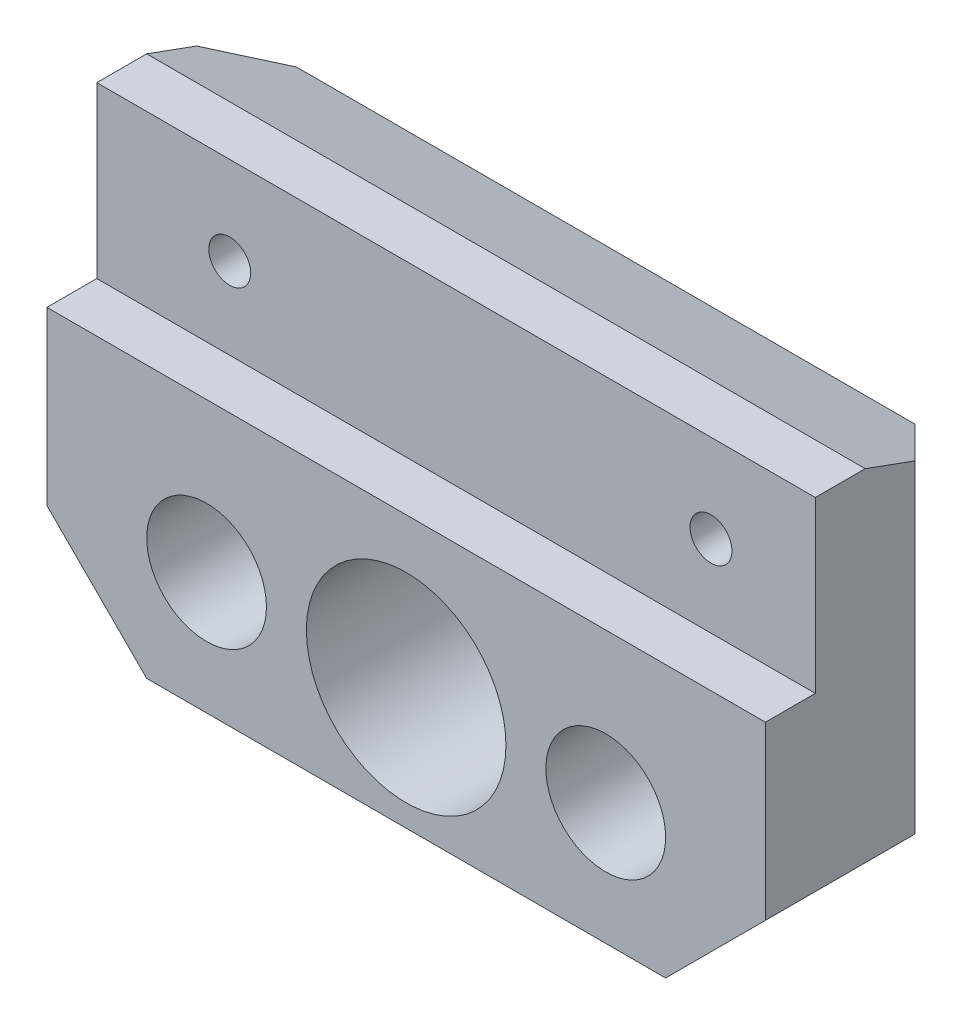
ISO-10303-21;
HEADER;
FILE_DESCRIPTION(('STEP AP214'),'2;1');
FILE_NAME('part.step','',(''),(''),'','','');
FILE_SCHEMA(('AUTOMOTIVE_DESIGN { 1 0 10303 214 1 1 1 1 }'));
ENDSEC;
DATA;
#1=APPLICATION_CONTEXT('core data for automotive mechanical design processes');
#2=APPLICATION_PROTOCOL_DEFINITION('international standard','automotive_design',2000,#1);
#3=PRODUCT_CONTEXT('',#1,'mechanical');
#4=PRODUCT('Part','Part','',(#3));
#5=PRODUCT_RELATED_PRODUCT_CATEGORY('part','',(#4));
#6=PRODUCT_DEFINITION_FORMATION('','',#4);
#7=PRODUCT_DEFINITION_CONTEXT('part definition',#1,'design');
#8=PRODUCT_DEFINITION('design','',#6,#7);
#9=PRODUCT_DEFINITION_SHAPE('','',#8);
#10=(LENGTH_UNIT() NAMED_UNIT(*) SI_UNIT(.MILLI.,.METRE.));
#11=(NAMED_UNIT(*) PLANE_ANGLE_UNIT() SI_UNIT($,.RADIAN.));
#12=(NAMED_UNIT(*) SI_UNIT($,.STERADIAN.) SOLID_ANGLE_UNIT());
#13=UNCERTAINTY_MEASURE_WITH_UNIT(LENGTH_MEASURE(1.E-05),#10,'distance_accuracy_value','');
#14=(GEOMETRIC_REPRESENTATION_CONTEXT(3) GLOBAL_UNCERTAINTY_ASSIGNED_CONTEXT((#13)) GLOBAL_UNIT_ASSIGNED_CONTEXT((#10,
#11,#12)) REPRESENTATION_CONTEXT('',''));
#15=CARTESIAN_POINT('',(0.,0.,0.));
#16=DIRECTION('',(0.,0.,1.));
#17=DIRECTION('',(1.,0.,0.));
#18=AXIS2_PLACEMENT_3D('',#15,#16,#17);
#19=CARTESIAN_POINT('',(53.9613003244463,-9.9,20.));
#20=DIRECTION('',(0.,0.,-1.));
#21=DIRECTION('',(-1.,0.,0.));
#22=AXIS2_PLACEMENT_3D('',#19,#20,#21);
#23=CYLINDRICAL_SURFACE('',#22,9.99999999999999);
#24=CARTESIAN_POINT('',(53.9613003244463,-9.9,20.));
#25=DIRECTION('',(0.,0.,1.));
#26=DIRECTION('',(1.,0.,0.));
#27=AXIS2_PLACEMENT_3D('',#24,#25,#26);
#28=CIRCLE('',#27,9.99999999999999);
#29=CARTESIAN_POINT('',(63.9613003244463,-9.9,20.));
#30=VERTEX_POINT('',#29);
#31=EDGE_CURVE('E178',#30,#30,#28,.T.);
#32=ORIENTED_EDGE('',*,*,#31,.T.);
#33=EDGE_LOOP('',(#32));
#34=FACE_BOUND('',#33,.T.);
#35=CARTESIAN_POINT('',(53.9613003244463,-9.9,3.4));
#36=DIRECTION('',(0.,0.,-1.));
#37=DIRECTION('',(-1.,0.,0.));
#38=AXIS2_PLACEMENT_3D('',#35,#36,#37);
#39=CIRCLE('',#38,9.99999999999999);
#40=CARTESIAN_POINT('',(43.9613003244463,-9.9,3.4));
#41=VERTEX_POINT('',#40);
#42=EDGE_CURVE('E43',#41,#41,#39,.T.);
#43=ORIENTED_EDGE('',*,*,#42,.T.);
#44=EDGE_LOOP('',(#43));
#45=FACE_BOUND('',#44,.T.);
#46=ADVANCED_FACE('F39',(#34,#45),#23,.F.);
#47=CARTESIAN_POINT('',(0.,0.,20.));
#48=DIRECTION('',(0.,0.,1.));
#49=DIRECTION('',(1.,0.,0.));
#50=AXIS2_PLACEMENT_3D('',#47,#48,#49);
#51=PLANE('',#50);
#52=DIRECTION('',(-1.,0.,0.));
#53=VECTOR('',#52,1.);
#54=CARTESIAN_POINT('',(97.9613003244462,5.1,20.));
#55=LINE('',#54,#53);
#56=CARTESIAN_POINT('',(89.9613003244463,5.1,20.));
#57=VERTEX_POINT('',#56);
#58=CARTESIAN_POINT('',(17.9613003244463,5.1,20.));
#59=VERTEX_POINT('',#58);
#60=EDGE_CURVE('E163',#57,#59,#55,.T.);
#61=ORIENTED_EDGE('',*,*,#60,.T.);
#62=DIRECTION('',(0.,-1.,0.));
#63=VECTOR('',#62,1.);
#64=CARTESIAN_POINT('',(17.9613003244463,22.1,20.));
#65=LINE('',#64,#63);
#66=CARTESIAN_POINT('',(17.9613003244463,-12.1,20.));
#67=VERTEX_POINT('',#66);
#68=EDGE_CURVE('E184',#59,#67,#65,.T.);
#69=ORIENTED_EDGE('',*,*,#68,.T.);
#70=DIRECTION('',(-0.707106781186547,0.707106781186548,0.));
#71=VECTOR('',#70,1.);
#72=CARTESIAN_POINT('',(2.93065016222317,2.93065016222317,20.));
#73=LINE('',#72,#71);
#74=CARTESIAN_POINT('',(27.9613003244463,-22.1,20.));
#75=VERTEX_POINT('',#74);
#76=EDGE_CURVE('E207',#67,#75,#73,.F.);
#77=ORIENTED_EDGE('',*,*,#76,.T.);
#78=DIRECTION('',(1.,0.,0.));
#79=VECTOR('',#78,1.);
#80=CARTESIAN_POINT('',(17.9613003244463,-22.1,20.));
#81=LINE('',#80,#79);
#82=CARTESIAN_POINT('',(79.9613003244462,-22.1,20.));
#83=VERTEX_POINT('',#82);
#84=EDGE_CURVE('E186',#75,#83,#81,.T.);
#85=ORIENTED_EDGE('',*,*,#84,.T.);
#86=DIRECTION('',(-0.707106781186549,-0.707106781186546,0.));
#87=VECTOR('',#86,1.);
#88=CARTESIAN_POINT('',(51.030650162223,-51.0306501622232,20.));
#89=LINE('',#88,#87);
#90=CARTESIAN_POINT('',(89.9613003244463,-12.1,20.));
#91=VERTEX_POINT('',#90);
#92=EDGE_CURVE('E215',#83,#91,#89,.F.);
#93=ORIENTED_EDGE('',*,*,#92,.T.);
#94=DIRECTION('',(0.,1.,0.));
#95=VECTOR('',#94,1.);
#96=CARTESIAN_POINT('',(89.9613003244463,22.1,20.));
#97=LINE('',#96,#95);
#98=EDGE_CURVE('E189',#91,#57,#97,.T.);
#99=ORIENTED_EDGE('',*,*,#98,.T.);
#100=EDGE_LOOP('',(#61,#69,#77,#85,#93,#99));
#101=FACE_BOUND('',#100,.T.);
#102=CARTESIAN_POINT('',(73.9613003244463,-9.90000000000001,20.));
#103=DIRECTION('',(0.,0.,1.));
#104=DIRECTION('',(1.,0.,0.));
#105=AXIS2_PLACEMENT_3D('',#102,#103,#104);
#106=CIRCLE('',#105,6.);
#107=CARTESIAN_POINT('',(79.9613003244463,-9.90000000000001,20.));
#108=VERTEX_POINT('',#107);
#109=EDGE_CURVE('E175',#108,#108,#106,.T.);
#110=ORIENTED_EDGE('',*,*,#109,.F.);
#111=EDGE_LOOP('',(#110));
#112=FACE_BOUND('',#111,.T.);
#113=ORIENTED_EDGE('',*,*,#31,.F.);
#114=EDGE_LOOP('',(#113));
#115=FACE_BOUND('',#114,.T.);
#116=CARTESIAN_POINT('',(33.9613003244463,-9.90000000000001,20.));
#117=DIRECTION('',(0.,0.,1.));
#118=DIRECTION('',(1.,0.,0.));
#119=AXIS2_PLACEMENT_3D('',#116,#117,#118);
#120=CIRCLE('',#119,6.);
#121=CARTESIAN_POINT('',(39.9613003244463,-9.90000000000001,20.));
#122=VERTEX_POINT('',#121);
#123=EDGE_CURVE('E169',#122,#122,#120,.T.);
#124=ORIENTED_EDGE('',*,*,#123,.F.);
#125=EDGE_LOOP('',(#124));
#126=FACE_BOUND('',#125,.T.);
#127=ADVANCED_FACE('F285',(#101,#112,#115,#126),#51,.T.);
#128=CARTESIAN_POINT('',(0.,0.,0.));
#129=DIRECTION('',(0.,0.,1.));
#130=DIRECTION('',(1.,0.,0.));
#131=AXIS2_PLACEMENT_3D('',#128,#129,#130);
#132=PLANE('',#131);
#133=CARTESIAN_POINT('',(53.9613003244463,-9.9,0.));
#134=DIRECTION('',(0.,0.,-1.));
#135=DIRECTION('',(-1.,0.,0.));
#136=AXIS2_PLACEMENT_3D('',#133,#134,#135);
#137=CIRCLE('',#136,12.);
#138=CARTESIAN_POINT('',(41.9613003244463,-9.9,0.));
#139=VERTEX_POINT('',#138);
#140=EDGE_CURVE('E151',#139,#139,#137,.T.);
#141=ORIENTED_EDGE('',*,*,#140,.F.);
#142=EDGE_LOOP('',(#141));
#143=FACE_BOUND('',#142,.T.);
#144=DIRECTION('',(0.707106781186547,-0.707106781186548,0.));
#145=VECTOR('',#144,1.);
#146=CARTESIAN_POINT('',(27.9613003244463,-22.1,0.));
#147=LINE('',#146,#145);
#148=CARTESIAN_POINT('',(27.9613003244463,-22.1,0.));
#149=VERTEX_POINT('',#148);
#150=CARTESIAN_POINT('',(22.9613003244463,-17.1,0.));
#151=VERTEX_POINT('',#150);
#152=EDGE_CURVE('E201',#149,#151,#147,.F.);
#153=ORIENTED_EDGE('',*,*,#152,.T.);
#154=DIRECTION('',(0.,1.,0.));
#155=VECTOR('',#154,1.);
#156=CARTESIAN_POINT('',(22.9613003244463,0.,0.));
#157=LINE('',#156,#155);
#158=CARTESIAN_POINT('',(22.9613003244463,18.460297657338,0.));
#159=VERTEX_POINT('',#158);
#160=EDGE_CURVE('E236',#151,#159,#157,.T.);
#161=ORIENTED_EDGE('',*,*,#160,.T.);
#162=DIRECTION('',(1.,0.,0.));
#163=VECTOR('',#162,1.);
#164=CARTESIAN_POINT('',(0.,18.460297657338,0.));
#165=LINE('',#164,#163);
#166=CARTESIAN_POINT('',(84.9613003244462,18.460297657338,0.));
#167=VERTEX_POINT('',#166);
#168=EDGE_CURVE('E223',#159,#167,#165,.T.);
#169=ORIENTED_EDGE('',*,*,#168,.T.);
#170=DIRECTION('',(0.,-1.,0.));
#171=VECTOR('',#170,1.);
#172=CARTESIAN_POINT('',(84.9613003244462,0.,0.));
#173=LINE('',#172,#171);
#174=CARTESIAN_POINT('',(84.9613003244462,-17.1,0.));
#175=VERTEX_POINT('',#174);
#176=EDGE_CURVE('E234',#167,#175,#173,.T.);
#177=ORIENTED_EDGE('',*,*,#176,.T.);
#178=DIRECTION('',(0.707106781186549,0.707106781186546,0.));
#179=VECTOR('',#178,1.);
#180=CARTESIAN_POINT('',(89.9613003244463,-12.1,0.));
#181=LINE('',#180,#179);
#182=CARTESIAN_POINT('',(79.9613003244462,-22.1,0.));
#183=VERTEX_POINT('',#182);
#184=EDGE_CURVE('E211',#175,#183,#181,.F.);
#185=ORIENTED_EDGE('',*,*,#184,.T.);
#186=DIRECTION('',(1.,0.,0.));
#187=VECTOR('',#186,1.);
#188=CARTESIAN_POINT('',(17.9613003244463,-22.1,0.));
#189=LINE('',#188,#187);
#190=EDGE_CURVE('E183',#149,#183,#189,.T.);
#191=ORIENTED_EDGE('',*,*,#190,.F.);
#192=EDGE_LOOP('',(#153,#161,#169,#177,#185,#191));
#193=FACE_BOUND('',#192,.T.);
#194=CARTESIAN_POINT('',(73.9613003244463,-9.90000000000001,0.));
#195=DIRECTION('',(0.,0.,1.));
#196=DIRECTION('',(1.,0.,0.));
#197=AXIS2_PLACEMENT_3D('',#194,#195,#196);
#198=CIRCLE('',#197,6.);
#199=CARTESIAN_POINT('',(79.9613003244463,-9.90000000000001,0.));
#200=VERTEX_POINT('',#199);
#201=EDGE_CURVE('E172',#200,#200,#198,.T.);
#202=ORIENTED_EDGE('',*,*,#201,.T.);
#203=EDGE_LOOP('',(#202));
#204=FACE_BOUND('',#203,.T.);
#205=CARTESIAN_POINT('',(33.9613003244463,-9.90000000000001,0.));
#206=DIRECTION('',(0.,0.,1.));
#207=DIRECTION('',(1.,0.,0.));
#208=AXIS2_PLACEMENT_3D('',#205,#206,#207);
#209=CIRCLE('',#208,6.);
#210=CARTESIAN_POINT('',(39.9613003244463,-9.90000000000001,0.));
#211=VERTEX_POINT('',#210);
#212=EDGE_CURVE('E168',#211,#211,#209,.T.);
#213=ORIENTED_EDGE('',*,*,#212,.T.);
#214=EDGE_LOOP('',(#213));
#215=FACE_BOUND('',#214,.T.);
#216=ADVANCED_FACE('F275',(#143,#193,#204,#215),#132,.F.);
#217=CARTESIAN_POINT('',(17.9613003244463,22.1,20.));
#218=DIRECTION('',(1.,0.,0.));
#219=DIRECTION('',(0.,0.,-1.));
#220=AXIS2_PLACEMENT_3D('',#217,#218,#219);
#221=PLANE('',#220);
#222=ORIENTED_EDGE('',*,*,#68,.F.);
#223=DIRECTION('',(0.,0.,1.));
#224=VECTOR('',#223,1.);
#225=CARTESIAN_POINT('',(17.9613003244463,5.1,15.));
#226=LINE('',#225,#224);
#227=CARTESIAN_POINT('',(17.9613003244463,5.1,15.));
#228=VERTEX_POINT('',#227);
#229=EDGE_CURVE('E160',#228,#59,#226,.T.);
#230=ORIENTED_EDGE('',*,*,#229,.F.);
#231=DIRECTION('',(0.,-1.,0.));
#232=VECTOR('',#231,1.);
#233=CARTESIAN_POINT('',(17.9613003244463,22.1,15.));
#234=LINE('',#233,#232);
#235=CARTESIAN_POINT('',(17.9613003244463,22.1,15.));
#236=VERTEX_POINT('',#235);
#237=EDGE_CURVE('E157',#236,#228,#234,.T.);
#238=ORIENTED_EDGE('',*,*,#237,.F.);
#239=DIRECTION('',(0.,0.,-1.));
#240=VECTOR('',#239,1.);
#241=CARTESIAN_POINT('',(17.9613003244463,22.1,20.));
#242=LINE('',#241,#240);
#243=CARTESIAN_POINT('',(17.9613003244463,22.1,10.0000000000001));
#244=VERTEX_POINT('',#243);
#245=EDGE_CURVE('E192',#236,#244,#242,.T.);
#246=ORIENTED_EDGE('',*,*,#245,.T.);
#247=DIRECTION('',(0.,0.342020143325667,0.939692620785909));
#248=VECTOR('',#247,1.);
#249=CARTESIAN_POINT('',(17.9613003244463,22.1,10.0000000000001));
#250=LINE('',#249,#248);
#251=CARTESIAN_POINT('',(17.9613003244463,20.280148828669,5.));
#252=VERTEX_POINT('',#251);
#253=EDGE_CURVE('E220',#244,#252,#250,.F.);
#254=ORIENTED_EDGE('',*,*,#253,.T.);
#255=DIRECTION('',(0.,-1.,0.));
#256=VECTOR('',#255,1.);
#257=CARTESIAN_POINT('',(17.9613003244463,22.1,5.));
#258=LINE('',#257,#256);
#259=CARTESIAN_POINT('',(17.9613003244463,-12.1,5.));
#260=VERTEX_POINT('',#259);
#261=EDGE_CURVE('E229',#252,#260,#258,.T.);
#262=ORIENTED_EDGE('',*,*,#261,.T.);
#263=DIRECTION('',(0.,0.,1.));
#264=VECTOR('',#263,1.);
#265=CARTESIAN_POINT('',(17.9613003244463,-12.1,20.));
#266=LINE('',#265,#264);
#267=EDGE_CURVE('E204',#260,#67,#266,.T.);
#268=ORIENTED_EDGE('',*,*,#267,.T.);
#269=EDGE_LOOP('',(#222,#230,#238,#246,#254,#262,#268));
#270=FACE_BOUND('',#269,.T.);
#271=ADVANCED_FACE('F264',(#270),#221,.F.);
#272=CARTESIAN_POINT('',(17.9613003244463,-22.1,20.));
#273=DIRECTION('',(0.,1.,0.));
#274=DIRECTION('',(0.,0.,1.));
#275=AXIS2_PLACEMENT_3D('',#272,#273,#274);
#276=PLANE('',#275);
#277=ORIENTED_EDGE('',*,*,#190,.T.);
#278=DIRECTION('',(0.,0.,1.));
#279=VECTOR('',#278,1.);
#280=CARTESIAN_POINT('',(79.9613003244462,-22.1,20.));
#281=LINE('',#280,#279);
#282=EDGE_CURVE('E213',#183,#83,#281,.T.);
#283=ORIENTED_EDGE('',*,*,#282,.T.);
#284=ORIENTED_EDGE('',*,*,#84,.F.);
#285=DIRECTION('',(0.,0.,-1.));
#286=VECTOR('',#285,1.);
#287=CARTESIAN_POINT('',(27.9613003244463,-22.1,20.));
#288=LINE('',#287,#286);
#289=EDGE_CURVE('E198',#75,#149,#288,.T.);
#290=ORIENTED_EDGE('',*,*,#289,.T.);
#291=EDGE_LOOP('',(#277,#283,#284,#290));
#292=FACE_BOUND('',#291,.T.);
#293=ADVANCED_FACE('F279',(#292),#276,.F.);
#294=CARTESIAN_POINT('',(89.9613003244463,22.1,20.));
#295=DIRECTION('',(-1.,0.,0.));
#296=DIRECTION('',(0.,0.,1.));
#297=AXIS2_PLACEMENT_3D('',#294,#295,#296);
#298=PLANE('',#297);
#299=DIRECTION('',(0.,-1.,0.));
#300=VECTOR('',#299,1.);
#301=CARTESIAN_POINT('',(89.9613003244463,22.1,15.));
#302=LINE('',#301,#300);
#303=CARTESIAN_POINT('',(89.9613003244463,22.1,15.));
#304=VERTEX_POINT('',#303);
#305=CARTESIAN_POINT('',(89.9613003244463,5.1,15.));
#306=VERTEX_POINT('',#305);
#307=EDGE_CURVE('E55',#304,#306,#302,.T.);
#308=ORIENTED_EDGE('',*,*,#307,.T.);
#309=DIRECTION('',(0.,0.,1.));
#310=VECTOR('',#309,1.);
#311=CARTESIAN_POINT('',(89.9613003244463,5.1,20.));
#312=LINE('',#311,#310);
#313=EDGE_CURVE('E11',#306,#57,#312,.T.);
#314=ORIENTED_EDGE('',*,*,#313,.T.);
#315=ORIENTED_EDGE('',*,*,#98,.F.);
#316=DIRECTION('',(0.,0.,-1.));
#317=VECTOR('',#316,1.);
#318=CARTESIAN_POINT('',(89.9613003244463,-12.1,20.));
#319=LINE('',#318,#317);
#320=CARTESIAN_POINT('',(89.9613003244463,-12.1,5.));
#321=VERTEX_POINT('',#320);
#322=EDGE_CURVE('E209',#91,#321,#319,.T.);
#323=ORIENTED_EDGE('',*,*,#322,.T.);
#324=DIRECTION('',(0.,1.,0.));
#325=VECTOR('',#324,1.);
#326=CARTESIAN_POINT('',(89.9613003244463,22.1,5.));
#327=LINE('',#326,#325);
#328=CARTESIAN_POINT('',(89.9613003244462,20.280148828669,5.));
#329=VERTEX_POINT('',#328);
#330=EDGE_CURVE('E242',#321,#329,#327,.T.);
#331=ORIENTED_EDGE('',*,*,#330,.T.);
#332=DIRECTION('',(0.,-0.342020143325667,-0.939692620785909));
#333=VECTOR('',#332,1.);
#334=CARTESIAN_POINT('',(89.9613003244462,22.1,10.0000000000001));
#335=LINE('',#334,#333);
#336=CARTESIAN_POINT('',(89.9613003244463,22.1,10.0000000000001));
#337=VERTEX_POINT('',#336);
#338=EDGE_CURVE('E226',#329,#337,#335,.F.);
#339=ORIENTED_EDGE('',*,*,#338,.T.);
#340=DIRECTION('',(0.,0.,-1.));
#341=VECTOR('',#340,1.);
#342=CARTESIAN_POINT('',(89.9613003244463,22.1,20.));
#343=LINE('',#342,#341);
#344=EDGE_CURVE('E196',#304,#337,#343,.T.);
#345=ORIENTED_EDGE('',*,*,#344,.F.);
#346=EDGE_LOOP('',(#308,#314,#315,#323,#331,#339,#345));
#347=FACE_BOUND('',#346,.T.);
#348=ADVANCED_FACE('F252',(#347),#298,.F.);
#349=CARTESIAN_POINT('',(17.9613003244463,22.1,20.));
#350=DIRECTION('',(0.,-1.,0.));
#351=DIRECTION('',(0.,0.,-1.));
#352=AXIS2_PLACEMENT_3D('',#349,#350,#351);
#353=PLANE('',#352);
#354=ORIENTED_EDGE('',*,*,#245,.F.);
#355=DIRECTION('',(1.,0.,0.));
#356=VECTOR('',#355,1.);
#357=CARTESIAN_POINT('',(17.9613003244463,22.1,15.));
#358=LINE('',#357,#356);
#359=EDGE_CURVE('E48',#236,#304,#358,.T.);
#360=ORIENTED_EDGE('',*,*,#359,.T.);
#361=ORIENTED_EDGE('',*,*,#344,.T.);
#362=DIRECTION('',(-1.,0.,0.));
#363=VECTOR('',#362,1.);
#364=CARTESIAN_POINT('',(17.9613003244463,22.1,10.0000000000001));
#365=LINE('',#364,#363);
#366=EDGE_CURVE('E217',#337,#244,#365,.T.);
#367=ORIENTED_EDGE('',*,*,#366,.T.);
#368=EDGE_LOOP('',(#354,#360,#361,#367));
#369=FACE_BOUND('',#368,.T.);
#370=ADVANCED_FACE('F249',(#369),#353,.F.);
#371=CARTESIAN_POINT('',(73.9613003244463,-9.90000000000001,20.));
#372=DIRECTION('',(0.,0.,-1.));
#373=DIRECTION('',(-1.,0.,0.));
#374=AXIS2_PLACEMENT_3D('',#371,#372,#373);
#375=CYLINDRICAL_SURFACE('',#374,6.);
#376=ORIENTED_EDGE('',*,*,#109,.T.);
#377=EDGE_LOOP('',(#376));
#378=FACE_BOUND('',#377,.T.);
#379=ORIENTED_EDGE('',*,*,#201,.F.);
#380=EDGE_LOOP('',(#379));
#381=FACE_BOUND('',#380,.T.);
#382=ADVANCED_FACE('F315',(#378,#381),#375,.F.);
#383=CARTESIAN_POINT('',(33.9613003244463,-9.90000000000001,20.));
#384=DIRECTION('',(0.,0.,-1.));
#385=DIRECTION('',(-1.,0.,0.));
#386=AXIS2_PLACEMENT_3D('',#383,#384,#385);
#387=CYLINDRICAL_SURFACE('',#386,6.);
#388=ORIENTED_EDGE('',*,*,#123,.T.);
#389=EDGE_LOOP('',(#388));
#390=FACE_BOUND('',#389,.T.);
#391=ORIENTED_EDGE('',*,*,#212,.F.);
#392=EDGE_LOOP('',(#391));
#393=FACE_BOUND('',#392,.T.);
#394=ADVANCED_FACE('F330',(#390,#393),#387,.F.);
#395=CARTESIAN_POINT('',(27.9613003244463,-22.1,20.));
#396=DIRECTION('',(0.707106781186548,0.707106781186547,0.));
#397=DIRECTION('',(0.,0.,-1.));
#398=AXIS2_PLACEMENT_3D('',#395,#396,#397);
#399=PLANE('',#398);
#400=ORIENTED_EDGE('',*,*,#267,.F.);
#401=DIRECTION('',(0.577350269189626,-0.577350269189628,-0.577350269189623));
#402=VECTOR('',#401,1.);
#403=CARTESIAN_POINT('',(19.627966991113,-13.7666666666667,3.33333333333328));
#404=LINE('',#403,#402);
#405=EDGE_CURVE('E232',#260,#151,#404,.T.);
#406=ORIENTED_EDGE('',*,*,#405,.T.);
#407=ORIENTED_EDGE('',*,*,#152,.F.);
#408=ORIENTED_EDGE('',*,*,#289,.F.);
#409=ORIENTED_EDGE('',*,*,#76,.F.);
#410=EDGE_LOOP('',(#400,#406,#407,#408,#409));
#411=FACE_BOUND('',#410,.T.);
#412=ADVANCED_FACE('F270',(#411),#399,.F.);
#413=CARTESIAN_POINT('',(89.9613003244463,-12.1,20.));
#414=DIRECTION('',(-0.707106781186546,0.707106781186549,0.));
#415=DIRECTION('',(0.,0.,-1.));
#416=AXIS2_PLACEMENT_3D('',#413,#414,#415);
#417=PLANE('',#416);
#418=ORIENTED_EDGE('',*,*,#184,.F.);
#419=DIRECTION('',(0.577350269189627,0.577350269189625,0.577350269189625));
#420=VECTOR('',#419,1.);
#421=CARTESIAN_POINT('',(94.9613003244463,-7.10000000000003,9.99999999999998));
#422=LINE('',#421,#420);
#423=EDGE_CURVE('E63',#175,#321,#422,.T.);
#424=ORIENTED_EDGE('',*,*,#423,.T.);
#425=ORIENTED_EDGE('',*,*,#322,.F.);
#426=ORIENTED_EDGE('',*,*,#92,.F.);
#427=ORIENTED_EDGE('',*,*,#282,.F.);
#428=EDGE_LOOP('',(#418,#424,#425,#426,#427));
#429=FACE_BOUND('',#428,.T.);
#430=ADVANCED_FACE('F282',(#429),#417,.F.);
#431=CARTESIAN_POINT('',(17.9613003244463,22.1,10.0000000000001));
#432=DIRECTION('',(0.,-0.939692620785909,0.342020143325667));
#433=DIRECTION('',(-1.,0.,0.));
#434=AXIS2_PLACEMENT_3D('',#431,#432,#433);
#435=PLANE('',#434);
#436=ORIENTED_EDGE('',*,*,#168,.F.);
#437=DIRECTION('',(-0.684791078771738,0.249243569363952,0.684791078771735));
#438=VECTOR('',#437,1.);
#439=CARTESIAN_POINT('',(15.305994432273,21.2466011362917,7.65530589217324));
#440=LINE('',#439,#438);
#441=EDGE_CURVE('E240',#159,#252,#440,.T.);
#442=ORIENTED_EDGE('',*,*,#441,.T.);
#443=ORIENTED_EDGE('',*,*,#253,.F.);
#444=ORIENTED_EDGE('',*,*,#366,.F.);
#445=ORIENTED_EDGE('',*,*,#338,.F.);
#446=DIRECTION('',(-0.684791078771738,-0.249243569363952,-0.684791078771735));
#447=VECTOR('',#446,1.);
#448=CARTESIAN_POINT('',(58.8530110639136,8.95765749889221,-26.1082892605326));
#449=LINE('',#448,#447);
#450=EDGE_CURVE('E238',#329,#167,#449,.T.);
#451=ORIENTED_EDGE('',*,*,#450,.T.);
#452=EDGE_LOOP('',(#436,#442,#443,#444,#445,#451));
#453=FACE_BOUND('',#452,.T.);
#454=ADVANCED_FACE('F259',(#453),#435,.F.);
#455=CARTESIAN_POINT('',(17.9613003244463,22.1,5.));
#456=DIRECTION('',(0.707106781186546,0.,0.70710678118655));
#457=DIRECTION('',(0.,-1.,0.));
#458=AXIS2_PLACEMENT_3D('',#455,#456,#457);
#459=PLANE('',#458);
#460=ORIENTED_EDGE('',*,*,#441,.F.);
#461=ORIENTED_EDGE('',*,*,#160,.F.);
#462=ORIENTED_EDGE('',*,*,#405,.F.);
#463=ORIENTED_EDGE('',*,*,#261,.F.);
#464=EDGE_LOOP('',(#460,#461,#462,#463));
#465=FACE_BOUND('',#464,.T.);
#466=ADVANCED_FACE('F267',(#465),#459,.F.);
#467=CARTESIAN_POINT('',(89.9613003244463,22.1,5.));
#468=DIRECTION('',(-0.707106781186546,0.,0.707106781186549));
#469=DIRECTION('',(0.,1.,0.));
#470=AXIS2_PLACEMENT_3D('',#467,#468,#469);
#471=PLANE('',#470);
#472=ORIENTED_EDGE('',*,*,#423,.F.);
#473=ORIENTED_EDGE('',*,*,#176,.F.);
#474=ORIENTED_EDGE('',*,*,#450,.F.);
#475=ORIENTED_EDGE('',*,*,#330,.F.);
#476=EDGE_LOOP('',(#472,#473,#474,#475));
#477=FACE_BOUND('',#476,.T.);
#478=ADVANCED_FACE('F41',(#477),#471,.F.);
#479=CARTESIAN_POINT('',(97.9613003244462,5.1,15.));
#480=DIRECTION('',(0.,-1.,0.));
#481=DIRECTION('',(0.,0.,-1.));
#482=AXIS2_PLACEMENT_3D('',#479,#480,#481);
#483=PLANE('',#482);
#484=DIRECTION('',(-1.,0.,0.));
#485=VECTOR('',#484,1.);
#486=CARTESIAN_POINT('',(97.9613003244462,5.1,15.));
#487=LINE('',#486,#485);
#488=EDGE_CURVE('E162',#306,#228,#487,.T.);
#489=ORIENTED_EDGE('',*,*,#488,.T.);
#490=ORIENTED_EDGE('',*,*,#229,.T.);
#491=ORIENTED_EDGE('',*,*,#60,.F.);
#492=ORIENTED_EDGE('',*,*,#313,.F.);
#493=EDGE_LOOP('',(#489,#490,#491,#492));
#494=FACE_BOUND('',#493,.T.);
#495=ADVANCED_FACE('F288',(#494),#483,.F.);
#496=CARTESIAN_POINT('',(97.9613003244462,22.1,15.));
#497=DIRECTION('',(0.,0.,-1.));
#498=DIRECTION('',(0.,1.,0.));
#499=AXIS2_PLACEMENT_3D('',#496,#497,#498);
#500=PLANE('',#499);
#501=CARTESIAN_POINT('',(31.2827272262109,13.2731752046943,15.));
#502=DIRECTION('',(0.,0.,1.));
#503=DIRECTION('',(1.,0.,0.));
#504=AXIS2_PLACEMENT_3D('',#501,#502,#503);
#505=CIRCLE('',#504,2.1);
#506=CARTESIAN_POINT('',(33.3827272262109,13.2731752046943,15.));
#507=VERTEX_POINT('',#506);
#508=EDGE_CURVE('E141',#507,#507,#505,.T.);
#509=ORIENTED_EDGE('',*,*,#508,.F.);
#510=EDGE_LOOP('',(#509));
#511=FACE_BOUND('',#510,.T.);
#512=CARTESIAN_POINT('',(79.505567547098,13.2731752046943,15.));
#513=DIRECTION('',(0.,0.,1.));
#514=DIRECTION('',(1.,0.,0.));
#515=AXIS2_PLACEMENT_3D('',#512,#513,#514);
#516=CIRCLE('',#515,2.1);
#517=CARTESIAN_POINT('',(81.605567547098,13.2731752046943,15.));
#518=VERTEX_POINT('',#517);
#519=EDGE_CURVE('E140',#518,#518,#516,.T.);
#520=ORIENTED_EDGE('',*,*,#519,.F.);
#521=EDGE_LOOP('',(#520));
#522=FACE_BOUND('',#521,.T.);
#523=ORIENTED_EDGE('',*,*,#359,.F.);
#524=ORIENTED_EDGE('',*,*,#237,.T.);
#525=ORIENTED_EDGE('',*,*,#488,.F.);
#526=ORIENTED_EDGE('',*,*,#307,.F.);
#527=EDGE_LOOP('',(#523,#524,#525,#526));
#528=FACE_BOUND('',#527,.T.);
#529=ADVANCED_FACE('F289',(#511,#522,#528),#500,.F.);
#530=CARTESIAN_POINT('',(53.9613003244463,-9.9,3.4));
#531=DIRECTION('',(0.,0.,-1.));
#532=DIRECTION('',(-1.,0.,0.));
#533=AXIS2_PLACEMENT_3D('',#530,#531,#532);
#534=CYLINDRICAL_SURFACE('',#533,12.);
#535=CARTESIAN_POINT('',(53.9613003244463,-9.9,3.4));
#536=DIRECTION('',(0.,0.,-1.));
#537=DIRECTION('',(-1.,0.,0.));
#538=AXIS2_PLACEMENT_3D('',#535,#536,#537);
#539=CIRCLE('',#538,12.);
#540=CARTESIAN_POINT('',(41.9613003244463,-9.9,3.4));
#541=VERTEX_POINT('',#540);
#542=EDGE_CURVE('E152',#541,#541,#539,.T.);
#543=ORIENTED_EDGE('',*,*,#542,.F.);
#544=EDGE_LOOP('',(#543));
#545=FACE_BOUND('',#544,.T.);
#546=ORIENTED_EDGE('',*,*,#140,.T.);
#547=EDGE_LOOP('',(#546));
#548=FACE_BOUND('',#547,.T.);
#549=ADVANCED_FACE('F292',(#545,#548),#534,.F.);
#550=CARTESIAN_POINT('',(53.9613003244463,-9.9,3.4));
#551=DIRECTION('',(0.,0.,-1.));
#552=DIRECTION('',(-1.,0.,0.));
#553=AXIS2_PLACEMENT_3D('',#550,#551,#552);
#554=PLANE('',#553);
#555=ORIENTED_EDGE('',*,*,#42,.F.);
#556=EDGE_LOOP('',(#555));
#557=FACE_BOUND('',#556,.T.);
#558=ORIENTED_EDGE('',*,*,#542,.T.);
#559=EDGE_LOOP('',(#558));
#560=FACE_BOUND('',#559,.T.);
#561=ADVANCED_FACE('F299',(#557,#560),#554,.T.);
#562=CARTESIAN_POINT('',(79.505567547098,13.2731752046943,3.00000000000005));
#563=DIRECTION('',(0.,0.,1.));
#564=DIRECTION('',(1.,0.,0.));
#565=AXIS2_PLACEMENT_3D('',#562,#563,#564);
#566=CONICAL_SURFACE('',#565,2.09999999999999,1.02974425867665);
#567=CARTESIAN_POINT('',(79.505567547098,13.2731752046943,1.73819270004217));
#568=VERTEX_POINT('',#567);
#569=VERTEX_LOOP('',#568);
#570=FACE_BOUND('',#569,.T.);
#571=CARTESIAN_POINT('',(79.505567547098,13.2731752046943,3.00000000000005));
#572=DIRECTION('',(0.,0.,1.));
#573=DIRECTION('',(1.,0.,0.));
#574=AXIS2_PLACEMENT_3D('',#571,#572,#573);
#575=CIRCLE('',#574,2.09999999999999);
#576=CARTESIAN_POINT('',(81.605567547098,13.2731752046943,3.00000000000005));
#577=VERTEX_POINT('',#576);
#578=EDGE_CURVE('E144',#577,#577,#575,.T.);
#579=ORIENTED_EDGE('',*,*,#578,.T.);
#580=EDGE_LOOP('',(#579));
#581=FACE_BOUND('',#580,.T.);
#582=ADVANCED_FACE('F378',(#570,#581),#566,.F.);
#583=CARTESIAN_POINT('',(79.505567547098,13.2731752046943,15.));
#584=DIRECTION('',(0.,0.,1.));
#585=DIRECTION('',(1.,0.,0.));
#586=AXIS2_PLACEMENT_3D('',#583,#584,#585);
#587=CYLINDRICAL_SURFACE('',#586,2.1);
#588=ORIENTED_EDGE('',*,*,#578,.F.);
#589=EDGE_LOOP('',(#588));
#590=FACE_BOUND('',#589,.T.);
#591=ORIENTED_EDGE('',*,*,#519,.T.);
#592=EDGE_LOOP('',(#591));
#593=FACE_BOUND('',#592,.T.);
#594=ADVANCED_FACE('F134',(#590,#593),#587,.F.);
#595=CARTESIAN_POINT('',(31.2827272262109,13.2731752046943,3.00000000000005));
#596=DIRECTION('',(0.,0.,1.));
#597=DIRECTION('',(1.,0.,0.));
#598=AXIS2_PLACEMENT_3D('',#595,#596,#597);
#599=CONICAL_SURFACE('',#598,2.1,1.02974425867665);
#600=CARTESIAN_POINT('',(31.2827272262109,13.2731752046943,1.73819270004217));
#601=VERTEX_POINT('',#600);
#602=VERTEX_LOOP('',#601);
#603=FACE_BOUND('',#602,.T.);
#604=CARTESIAN_POINT('',(31.2827272262109,13.2731752046943,3.00000000000005));
#605=DIRECTION('',(0.,0.,1.));
#606=DIRECTION('',(1.,0.,0.));
#607=AXIS2_PLACEMENT_3D('',#604,#605,#606);
#608=CIRCLE('',#607,2.1);
#609=CARTESIAN_POINT('',(33.3827272262109,13.2731752046943,3.00000000000005));
#610=VERTEX_POINT('',#609);
#611=EDGE_CURVE('E138',#610,#610,#608,.T.);
#612=ORIENTED_EDGE('',*,*,#611,.T.);
#613=EDGE_LOOP('',(#612));
#614=FACE_BOUND('',#613,.T.);
#615=ADVANCED_FACE('F130',(#603,#614),#599,.F.);
#616=CARTESIAN_POINT('',(31.2827272262109,13.2731752046943,15.));
#617=DIRECTION('',(0.,0.,1.));
#618=DIRECTION('',(1.,0.,0.));
#619=AXIS2_PLACEMENT_3D('',#616,#617,#618);
#620=CYLINDRICAL_SURFACE('',#619,2.1);
#621=ORIENTED_EDGE('',*,*,#611,.F.);
#622=EDGE_LOOP('',(#621));
#623=FACE_BOUND('',#622,.T.);
#624=ORIENTED_EDGE('',*,*,#508,.T.);
#625=EDGE_LOOP('',(#624));
#626=FACE_BOUND('',#625,.T.);
#627=ADVANCED_FACE('F133',(#623,#626),#620,.F.);
#628=CLOSED_SHELL('',(#46,#127,#216,#271,#293,#348,#370,#382,#394,#412,#430,#454,#466,#478,#495,
#529,#549,#561,#582,#594,#615,#627));
#629=MANIFOLD_SOLID_BREP('B2',#628);
#630=ADVANCED_BREP_SHAPE_REPRESENTATION('',(#18,#629),#14);
#631=SHAPE_DEFINITION_REPRESENTATION(#9,#630);
ENDSEC;
END-ISO-10303-21;
